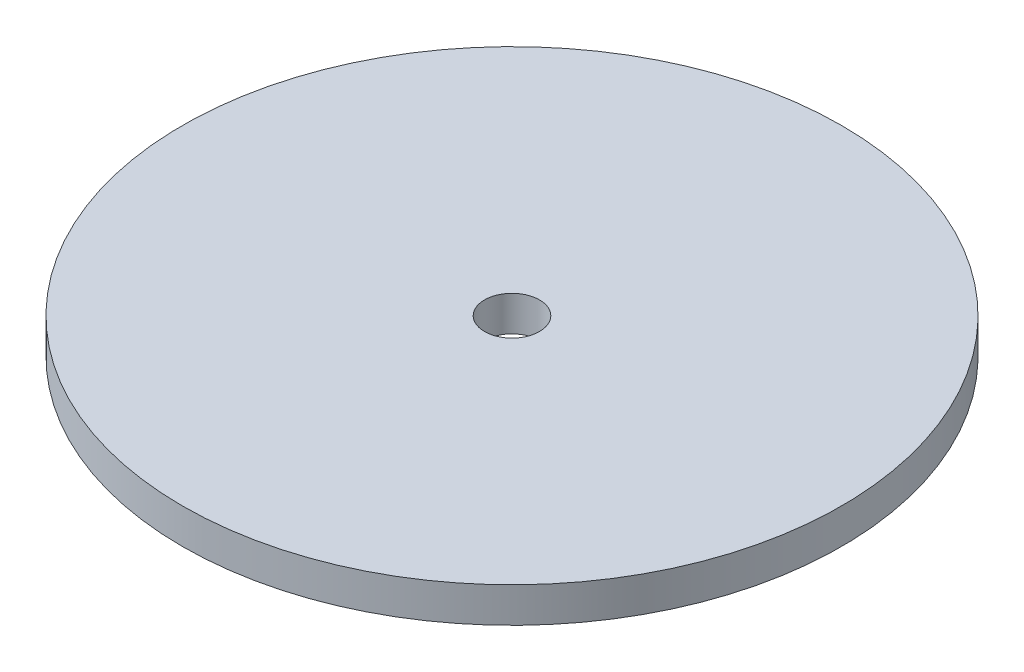
ISO-10303-21;
HEADER;
FILE_DESCRIPTION(('STEP AP214'),'2;1');
FILE_NAME('part.step','',(''),(''),'','','');
FILE_SCHEMA(('AUTOMOTIVE_DESIGN { 1 0 10303 214 1 1 1 1 }'));
ENDSEC;
DATA;
#1=APPLICATION_CONTEXT('core data for automotive mechanical design processes');
#2=APPLICATION_PROTOCOL_DEFINITION('international standard','automotive_design',2000,#1);
#3=PRODUCT_CONTEXT('',#1,'mechanical');
#4=PRODUCT('Part','Part','',(#3));
#5=PRODUCT_RELATED_PRODUCT_CATEGORY('part','',(#4));
#6=PRODUCT_DEFINITION_FORMATION('','',#4);
#7=PRODUCT_DEFINITION_CONTEXT('part definition',#1,'design');
#8=PRODUCT_DEFINITION('design','',#6,#7);
#9=PRODUCT_DEFINITION_SHAPE('','',#8);
#10=(LENGTH_UNIT() NAMED_UNIT(*) SI_UNIT(.MILLI.,.METRE.));
#11=(NAMED_UNIT(*) PLANE_ANGLE_UNIT() SI_UNIT($,.RADIAN.));
#12=(NAMED_UNIT(*) SI_UNIT($,.STERADIAN.) SOLID_ANGLE_UNIT());
#13=UNCERTAINTY_MEASURE_WITH_UNIT(LENGTH_MEASURE(1.E-05),#10,'distance_accuracy_value','');
#14=(GEOMETRIC_REPRESENTATION_CONTEXT(3) GLOBAL_UNCERTAINTY_ASSIGNED_CONTEXT((#13)) GLOBAL_UNIT_ASSIGNED_CONTEXT((#10,
#11,#12)) REPRESENTATION_CONTEXT('',''));
#15=CARTESIAN_POINT('',(0.,0.,0.));
#16=DIRECTION('',(0.,0.,1.));
#17=DIRECTION('',(1.,0.,0.));
#18=AXIS2_PLACEMENT_3D('',#15,#16,#17);
#19=CARTESIAN_POINT('',(0.,4.064,0.));
#20=DIRECTION('',(0.,1.,0.));
#21=DIRECTION('',(0.,0.,1.));
#22=AXIS2_PLACEMENT_3D('',#19,#20,#21);
#23=PLANE('',#22);
#24=CARTESIAN_POINT('',(0.,4.064,0.));
#25=DIRECTION('',(0.,1.,0.));
#26=DIRECTION('',(0.,0.,1.));
#27=AXIS2_PLACEMENT_3D('',#24,#25,#26);
#28=CIRCLE('',#27,38.1);
#29=CARTESIAN_POINT('',(0.,4.064,38.1));
#30=VERTEX_POINT('',#29);
#31=EDGE_CURVE('E10',#30,#30,#28,.T.);
#32=ORIENTED_EDGE('',*,*,#31,.T.);
#33=EDGE_LOOP('',(#32));
#34=FACE_BOUND('',#33,.T.);
#35=CARTESIAN_POINT('',(0.,4.064,0.));
#36=DIRECTION('',(0.,1.,0.));
#37=DIRECTION('',(0.,0.,1.));
#38=AXIS2_PLACEMENT_3D('',#35,#36,#37);
#39=CIRCLE('',#38,3.175);
#40=CARTESIAN_POINT('',(0.,4.064,3.175));
#41=VERTEX_POINT('',#40);
#42=EDGE_CURVE('E42',#41,#41,#39,.T.);
#43=ORIENTED_EDGE('',*,*,#42,.F.);
#44=EDGE_LOOP('',(#43));
#45=FACE_BOUND('',#44,.T.);
#46=ADVANCED_FACE('F31',(#34,#45),#23,.T.);
#47=CARTESIAN_POINT('',(0.,0.,0.));
#48=DIRECTION('',(0.,1.,0.));
#49=DIRECTION('',(0.,0.,1.));
#50=AXIS2_PLACEMENT_3D('',#47,#48,#49);
#51=PLANE('',#50);
#52=CARTESIAN_POINT('',(0.,0.,0.));
#53=DIRECTION('',(0.,1.,0.));
#54=DIRECTION('',(0.,0.,1.));
#55=AXIS2_PLACEMENT_3D('',#52,#53,#54);
#56=CIRCLE('',#55,38.1);
#57=CARTESIAN_POINT('',(0.,0.,38.1));
#58=VERTEX_POINT('',#57);
#59=EDGE_CURVE('E35',#58,#58,#56,.T.);
#60=ORIENTED_EDGE('',*,*,#59,.F.);
#61=EDGE_LOOP('',(#60));
#62=FACE_BOUND('',#61,.T.);
#63=CARTESIAN_POINT('',(0.,0.,0.));
#64=DIRECTION('',(0.,1.,0.));
#65=DIRECTION('',(0.,0.,1.));
#66=AXIS2_PLACEMENT_3D('',#63,#64,#65);
#67=CIRCLE('',#66,3.175);
#68=CARTESIAN_POINT('',(0.,0.,3.175));
#69=VERTEX_POINT('',#68);
#70=EDGE_CURVE('E44',#69,#69,#67,.T.);
#71=ORIENTED_EDGE('',*,*,#70,.T.);
#72=EDGE_LOOP('',(#71));
#73=FACE_BOUND('',#72,.T.);
#74=ADVANCED_FACE('F54',(#62,#73),#51,.F.);
#75=CARTESIAN_POINT('',(0.,4.064,0.));
#76=DIRECTION('',(0.,-1.,0.));
#77=DIRECTION('',(0.,0.,-1.));
#78=AXIS2_PLACEMENT_3D('',#75,#76,#77);
#79=CYLINDRICAL_SURFACE('',#78,38.1);
#80=ORIENTED_EDGE('',*,*,#31,.F.);
#81=EDGE_LOOP('',(#80));
#82=FACE_BOUND('',#81,.T.);
#83=ORIENTED_EDGE('',*,*,#59,.T.);
#84=EDGE_LOOP('',(#83));
#85=FACE_BOUND('',#84,.T.);
#86=ADVANCED_FACE('F33',(#82,#85),#79,.T.);
#87=CARTESIAN_POINT('',(0.,4.064,0.));
#88=DIRECTION('',(0.,-1.,0.));
#89=DIRECTION('',(0.,0.,-1.));
#90=AXIS2_PLACEMENT_3D('',#87,#88,#89);
#91=CYLINDRICAL_SURFACE('',#90,3.175);
#92=ORIENTED_EDGE('',*,*,#42,.T.);
#93=EDGE_LOOP('',(#92));
#94=FACE_BOUND('',#93,.T.);
#95=ORIENTED_EDGE('',*,*,#70,.F.);
#96=EDGE_LOOP('',(#95));
#97=FACE_BOUND('',#96,.T.);
#98=ADVANCED_FACE('F50',(#94,#97),#91,.F.);
#99=CLOSED_SHELL('',(#46,#74,#86,#98));
#100=MANIFOLD_SOLID_BREP('B2',#99);
#101=ADVANCED_BREP_SHAPE_REPRESENTATION('',(#18,#100),#14);
#102=SHAPE_DEFINITION_REPRESENTATION(#9,#101);
ENDSEC;
END-ISO-10303-21;
